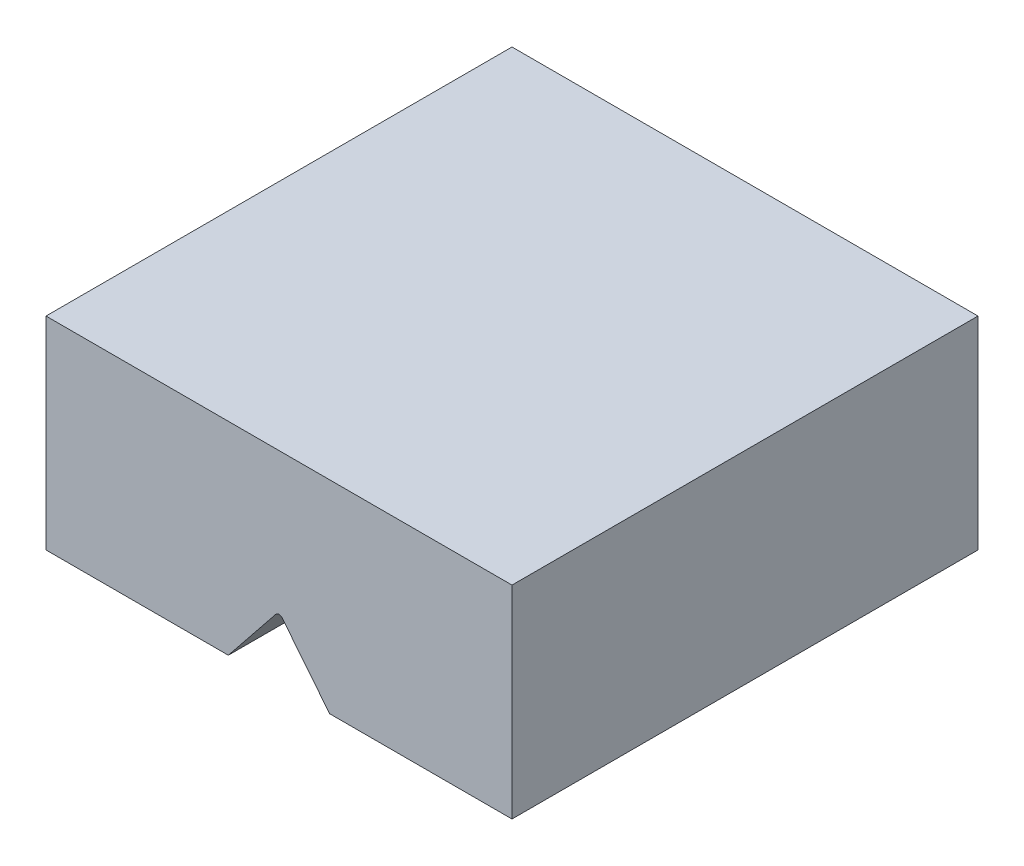
ISO-10303-21;
HEADER;
FILE_DESCRIPTION(('STEP AP214'),'2;1');
FILE_NAME('part.step','',(''),(''),'','','');
FILE_SCHEMA(('AUTOMOTIVE_DESIGN { 1 0 10303 214 1 1 1 1 }'));
ENDSEC;
DATA;
#1=APPLICATION_CONTEXT('core data for automotive mechanical design processes');
#2=APPLICATION_PROTOCOL_DEFINITION('international standard','automotive_design',2000,#1);
#3=PRODUCT_CONTEXT('',#1,'mechanical');
#4=PRODUCT('Part','Part','',(#3));
#5=PRODUCT_RELATED_PRODUCT_CATEGORY('part','',(#4));
#6=PRODUCT_DEFINITION_FORMATION('','',#4);
#7=PRODUCT_DEFINITION_CONTEXT('part definition',#1,'design');
#8=PRODUCT_DEFINITION('design','',#6,#7);
#9=PRODUCT_DEFINITION_SHAPE('','',#8);
#10=(LENGTH_UNIT() NAMED_UNIT(*) SI_UNIT(.MILLI.,.METRE.));
#11=(NAMED_UNIT(*) PLANE_ANGLE_UNIT() SI_UNIT($,.RADIAN.));
#12=(NAMED_UNIT(*) SI_UNIT($,.STERADIAN.) SOLID_ANGLE_UNIT());
#13=UNCERTAINTY_MEASURE_WITH_UNIT(LENGTH_MEASURE(1.E-05),#10,'distance_accuracy_value','');
#14=(GEOMETRIC_REPRESENTATION_CONTEXT(3) GLOBAL_UNCERTAINTY_ASSIGNED_CONTEXT((#13)) GLOBAL_UNIT_ASSIGNED_CONTEXT((#10,
#11,#12)) REPRESENTATION_CONTEXT('',''));
#15=CARTESIAN_POINT('',(0.,0.,0.));
#16=DIRECTION('',(0.,0.,1.));
#17=DIRECTION('',(1.,0.,0.));
#18=AXIS2_PLACEMENT_3D('',#15,#16,#17);
#19=CARTESIAN_POINT('',(0.,2.8,-11.5));
#20=DIRECTION('',(0.,0.,1.));
#21=DIRECTION('',(1.,0.,0.));
#22=AXIS2_PLACEMENT_3D('',#19,#20,#21);
#23=CYLINDRICAL_SURFACE('',#22,0.2);
#24=DIRECTION('',(0.,0.,1.));
#25=VECTOR('',#24,1.);
#26=CARTESIAN_POINT('',(-0.156072850189285,2.92506504481186,-11.5));
#27=LINE('',#26,#25);
#28=CARTESIAN_POINT('',(-0.156072850189285,2.92506504481186,2.19445694089307));
#29=VERTEX_POINT('',#28);
#30=CARTESIAN_POINT('',(-0.156072850189285,2.92506504481186,11.5));
#31=VERTEX_POINT('',#30);
#32=EDGE_CURVE('E117',#29,#31,#27,.T.);
#33=ORIENTED_EDGE('',*,*,#32,.F.);
#34=CARTESIAN_POINT('',(-0.156072850189285,2.92506504481186,2.19445694089307));
#35=CARTESIAN_POINT('',(-0.149043401205132,2.93385215810075,2.19495773255974));
#36=CARTESIAN_POINT('',(-0.141260961125301,2.94203144614838,2.1954765928498));
#37=CARTESIAN_POINT('',(-0.124441902674905,2.95697020830954,2.1964935797168));
#38=CARTESIAN_POINT('',(-0.115406008170376,2.96373049626863,2.19699171804631));
#39=CARTESIAN_POINT('',(-0.0963183832034033,2.9756406610106,2.1979113277802));
#40=CARTESIAN_POINT('',(-0.0862661431640993,2.98078972460446,2.19833276042628));
#41=CARTESIAN_POINT('',(-0.0654382759261339,2.98932616166957,2.19905120844462));
#42=CARTESIAN_POINT('',(-0.0546628281124281,2.99271397019372,2.19934825453845));
#43=CARTESIAN_POINT('',(-0.0327162842170274,2.99762548623186,2.19978403393633));
#44=CARTESIAN_POINT('',(-0.0215460890948283,2.99915318802112,2.19992310641964));
#45=CARTESIAN_POINT('',(0.000894188694473311,3.00031332998653,2.20002842729146));
#46=CARTESIAN_POINT('',(0.0121642801730675,2.99994560127907,2.19999466027991));
#47=CARTESIAN_POINT('',(0.0344464080922265,2.99732942295035,2.19975845150234));
#48=CARTESIAN_POINT('',(0.0454591379126752,2.99508682426655,2.1995565344924));
#49=CARTESIAN_POINT('',(0.0669541203329366,2.98879240070898,2.19900723785628));
#50=CARTESIAN_POINT('',(0.0774362318468145,2.98474009743741,2.19865981976822));
#51=CARTESIAN_POINT('',(0.0975934125639887,2.9749328435772,2.19785750928595));
#52=CARTESIAN_POINT('',(0.107266718902936,2.9691742920412,2.19740239000718));
#53=CARTESIAN_POINT('',(0.125497754414763,2.95612664705949,2.19643655794476));
#54=CARTESIAN_POINT('',(0.134057113740576,2.94883983183817,2.19592592845142));
#55=CARTESIAN_POINT('',(0.146933090529349,2.93587214921862,2.19509361053776));
#56=CARTESIAN_POINT('',(0.151652390930171,2.93058619510827,2.1947714981564));
#57=CARTESIAN_POINT('',(0.156072850189285,2.92506504481186,2.19445694089308));
#58=B_SPLINE_CURVE_WITH_KNOTS('',3,(#34,#35,#36,#37,#38,#39,#40,#41,#42,#43,#44,#45,#46,#47,#48,
#49,#50,#51,#52,#53,#54,#55,#56,#57),.UNSPECIFIED.,.F.,.F.,(4,2,2,2,2,2,2,2,2,2,2,4),(0.,
0.0337475148096952,0.0674756210459201,0.10122072258918,0.134957484688629,0.168621674111224,
0.202288863078285,0.235851376790638,0.269422768054256,0.303065520843038,0.336658473470274,
0.357897338058847),.UNSPECIFIED.);
#59=CARTESIAN_POINT('',(0.156072850189285,2.92506504481186,2.19445694089308));
#60=VERTEX_POINT('',#59);
#61=EDGE_CURVE('E108',#29,#60,#58,.T.);
#62=ORIENTED_EDGE('',*,*,#61,.T.);
#63=DIRECTION('',(0.,0.,1.));
#64=VECTOR('',#63,1.);
#65=CARTESIAN_POINT('',(0.156072850189285,2.92506504481186,-11.5));
#66=LINE('',#65,#64);
#67=CARTESIAN_POINT('',(0.156072850189285,2.92506504481186,11.5));
#68=VERTEX_POINT('',#67);
#69=EDGE_CURVE('E115',#60,#68,#66,.T.);
#70=ORIENTED_EDGE('',*,*,#69,.T.);
#71=CARTESIAN_POINT('',(0.,2.8,11.5));
#72=DIRECTION('',(0.,0.,1.));
#73=DIRECTION('',(-1.,0.,0.));
#74=AXIS2_PLACEMENT_3D('',#71,#72,#73);
#75=CIRCLE('',#74,0.2);
#76=EDGE_CURVE('E185',#68,#31,#75,.T.);
#77=ORIENTED_EDGE('',*,*,#76,.T.);
#78=EDGE_LOOP('',(#33,#62,#70,#77));
#79=FACE_BOUND('',#78,.T.);
#80=ADVANCED_FACE('F33',(#79),#23,.F.);
#81=CARTESIAN_POINT('',(0.,0.,0.));
#82=DIRECTION('',(0.,-1.,0.));
#83=DIRECTION('',(0.,0.,-1.));
#84=AXIS2_PLACEMENT_3D('',#81,#82,#83);
#85=PLANE('',#84);
#86=DIRECTION('',(0.,0.,1.));
#87=VECTOR('',#86,1.);
#88=CARTESIAN_POINT('',(-2.5,0.,-11.5));
#89=LINE('',#88,#87);
#90=CARTESIAN_POINT('',(-2.5,0.,-11.5));
#91=VERTEX_POINT('',#90);
#92=CARTESIAN_POINT('',(-2.5,0.,11.5));
#93=VERTEX_POINT('',#92);
#94=EDGE_CURVE('E148',#91,#93,#89,.T.);
#95=ORIENTED_EDGE('',*,*,#94,.T.);
#96=DIRECTION('',(1.,0.,0.));
#97=VECTOR('',#96,1.);
#98=CARTESIAN_POINT('',(-11.5,0.,11.5));
#99=LINE('',#98,#97);
#100=CARTESIAN_POINT('',(-11.5,0.,11.5));
#101=VERTEX_POINT('',#100);
#102=EDGE_CURVE('E149',#101,#93,#99,.T.);
#103=ORIENTED_EDGE('',*,*,#102,.F.);
#104=DIRECTION('',(0.,0.,1.));
#105=VECTOR('',#104,1.);
#106=CARTESIAN_POINT('',(-11.5,0.,11.5));
#107=LINE('',#106,#105);
#108=CARTESIAN_POINT('',(-11.5,0.,-11.5));
#109=VERTEX_POINT('',#108);
#110=EDGE_CURVE('E144',#109,#101,#107,.T.);
#111=ORIENTED_EDGE('',*,*,#110,.F.);
#112=DIRECTION('',(-1.,0.,0.));
#113=VECTOR('',#112,1.);
#114=CARTESIAN_POINT('',(-11.5,0.,-11.5));
#115=LINE('',#114,#113);
#116=EDGE_CURVE('E154',#91,#109,#115,.T.);
#117=ORIENTED_EDGE('',*,*,#116,.F.);
#118=EDGE_LOOP('',(#95,#103,#111,#117));
#119=FACE_BOUND('',#118,.T.);
#120=ADVANCED_FACE('F177',(#119),#85,.T.);
#121=CARTESIAN_POINT('',(-11.5,10.,11.5));
#122=DIRECTION('',(1.,0.,0.));
#123=DIRECTION('',(0.,0.,-1.));
#124=AXIS2_PLACEMENT_3D('',#121,#122,#123);
#125=PLANE('',#124);
#126=ORIENTED_EDGE('',*,*,#110,.T.);
#127=DIRECTION('',(0.,-1.,0.));
#128=VECTOR('',#127,1.);
#129=CARTESIAN_POINT('',(-11.5,10.,11.5));
#130=LINE('',#129,#128);
#131=CARTESIAN_POINT('',(-11.5,10.,11.5));
#132=VERTEX_POINT('',#131);
#133=EDGE_CURVE('E41',#132,#101,#130,.T.);
#134=ORIENTED_EDGE('',*,*,#133,.F.);
#135=DIRECTION('',(0.,0.,1.));
#136=VECTOR('',#135,1.);
#137=CARTESIAN_POINT('',(-11.5,10.,11.5));
#138=LINE('',#137,#136);
#139=CARTESIAN_POINT('',(-11.5,10.,-11.5));
#140=VERTEX_POINT('',#139);
#141=EDGE_CURVE('E133',#140,#132,#138,.T.);
#142=ORIENTED_EDGE('',*,*,#141,.F.);
#143=DIRECTION('',(0.,-1.,0.));
#144=VECTOR('',#143,1.);
#145=CARTESIAN_POINT('',(-11.5,10.,-11.5));
#146=LINE('',#145,#144);
#147=EDGE_CURVE('E143',#140,#109,#146,.T.);
#148=ORIENTED_EDGE('',*,*,#147,.T.);
#149=EDGE_LOOP('',(#126,#134,#142,#148));
#150=FACE_BOUND('',#149,.T.);
#151=ADVANCED_FACE('F35',(#150),#125,.F.);
#152=CARTESIAN_POINT('',(-11.5,10.,11.5));
#153=DIRECTION('',(0.,0.,-1.));
#154=DIRECTION('',(-1.,0.,0.));
#155=AXIS2_PLACEMENT_3D('',#152,#153,#154);
#156=PLANE('',#155);
#157=ORIENTED_EDGE('',*,*,#102,.T.);
#158=DIRECTION('',(-0.625325224059309,-0.780364250946425,0.));
#159=VECTOR('',#158,1.);
#160=CARTESIAN_POINT('',(-2.5,0.,11.5));
#161=LINE('',#160,#159);
#162=EDGE_CURVE('E183',#31,#93,#161,.T.);
#163=ORIENTED_EDGE('',*,*,#162,.F.);
#164=ORIENTED_EDGE('',*,*,#76,.F.);
#165=DIRECTION('',(-0.625325224059308,0.780364250946426,0.));
#166=VECTOR('',#165,1.);
#167=CARTESIAN_POINT('',(0.156072850189285,2.92506504481186,11.5));
#168=LINE('',#167,#166);
#169=CARTESIAN_POINT('',(2.5,0.,11.5));
#170=VERTEX_POINT('',#169);
#171=EDGE_CURVE('E122',#170,#68,#168,.T.);
#172=ORIENTED_EDGE('',*,*,#171,.F.);
#173=CARTESIAN_POINT('',(11.5,0.,11.5));
#174=VERTEX_POINT('',#173);
#175=EDGE_CURVE('E147',#170,#174,#99,.T.);
#176=ORIENTED_EDGE('',*,*,#175,.T.);
#177=DIRECTION('',(0.,-1.,0.));
#178=VECTOR('',#177,1.);
#179=CARTESIAN_POINT('',(11.5,10.,11.5));
#180=LINE('',#179,#178);
#181=CARTESIAN_POINT('',(11.5,10.,11.5));
#182=VERTEX_POINT('',#181);
#183=EDGE_CURVE('E162',#182,#174,#180,.T.);
#184=ORIENTED_EDGE('',*,*,#183,.F.);
#185=DIRECTION('',(1.,0.,0.));
#186=VECTOR('',#185,1.);
#187=CARTESIAN_POINT('',(-11.5,10.,11.5));
#188=LINE('',#187,#186);
#189=EDGE_CURVE('E136',#132,#182,#188,.T.);
#190=ORIENTED_EDGE('',*,*,#189,.F.);
#191=ORIENTED_EDGE('',*,*,#133,.T.);
#192=EDGE_LOOP('',(#157,#163,#164,#172,#176,#184,#190,#191));
#193=FACE_BOUND('',#192,.T.);
#194=ADVANCED_FACE('F167',(#193),#156,.F.);
#195=CARTESIAN_POINT('',(11.5,10.,11.5));
#196=DIRECTION('',(-1.,0.,0.));
#197=DIRECTION('',(0.,0.,1.));
#198=AXIS2_PLACEMENT_3D('',#195,#196,#197);
#199=PLANE('',#198);
#200=DIRECTION('',(0.,0.,-1.));
#201=VECTOR('',#200,1.);
#202=CARTESIAN_POINT('',(11.5,0.,11.5));
#203=LINE('',#202,#201);
#204=CARTESIAN_POINT('',(11.5,0.,-11.5));
#205=VERTEX_POINT('',#204);
#206=EDGE_CURVE('E152',#174,#205,#203,.T.);
#207=ORIENTED_EDGE('',*,*,#206,.T.);
#208=DIRECTION('',(0.,-1.,0.));
#209=VECTOR('',#208,1.);
#210=CARTESIAN_POINT('',(11.5,10.,-11.5));
#211=LINE('',#210,#209);
#212=CARTESIAN_POINT('',(11.5,10.,-11.5));
#213=VERTEX_POINT('',#212);
#214=EDGE_CURVE('E159',#213,#205,#211,.T.);
#215=ORIENTED_EDGE('',*,*,#214,.F.);
#216=DIRECTION('',(0.,0.,-1.));
#217=VECTOR('',#216,1.);
#218=CARTESIAN_POINT('',(11.5,10.,11.5));
#219=LINE('',#218,#217);
#220=EDGE_CURVE('E139',#182,#213,#219,.T.);
#221=ORIENTED_EDGE('',*,*,#220,.F.);
#222=ORIENTED_EDGE('',*,*,#183,.T.);
#223=EDGE_LOOP('',(#207,#215,#221,#222));
#224=FACE_BOUND('',#223,.T.);
#225=ADVANCED_FACE('F236',(#224),#199,.F.);
#226=CARTESIAN_POINT('',(-11.5,10.,-11.5));
#227=DIRECTION('',(0.,0.,1.));
#228=DIRECTION('',(1.,0.,0.));
#229=AXIS2_PLACEMENT_3D('',#226,#227,#228);
#230=PLANE('',#229);
#231=CARTESIAN_POINT('',(0.,2.8,-11.5));
#232=DIRECTION('',(0.,0.,1.));
#233=DIRECTION('',(-1.,0.,0.));
#234=AXIS2_PLACEMENT_3D('',#231,#232,#233);
#235=CIRCLE('',#234,0.2);
#236=CARTESIAN_POINT('',(0.156072850189285,2.92506504481186,-11.5));
#237=VERTEX_POINT('',#236);
#238=CARTESIAN_POINT('',(-0.156072850189285,2.92506504481186,-11.5));
#239=VERTEX_POINT('',#238);
#240=EDGE_CURVE('E189',#237,#239,#235,.T.);
#241=ORIENTED_EDGE('',*,*,#240,.T.);
#242=DIRECTION('',(-0.625325224059309,-0.780364250946425,0.));
#243=VECTOR('',#242,1.);
#244=CARTESIAN_POINT('',(-2.5,0.,-11.5));
#245=LINE('',#244,#243);
#246=EDGE_CURVE('E127',#239,#91,#245,.T.);
#247=ORIENTED_EDGE('',*,*,#246,.T.);
#248=ORIENTED_EDGE('',*,*,#116,.T.);
#249=ORIENTED_EDGE('',*,*,#147,.F.);
#250=DIRECTION('',(-1.,0.,0.));
#251=VECTOR('',#250,1.);
#252=CARTESIAN_POINT('',(-11.5,10.,-11.5));
#253=LINE('',#252,#251);
#254=EDGE_CURVE('E141',#213,#140,#253,.T.);
#255=ORIENTED_EDGE('',*,*,#254,.F.);
#256=ORIENTED_EDGE('',*,*,#214,.T.);
#257=CARTESIAN_POINT('',(2.5,0.,-11.5));
#258=VERTEX_POINT('',#257);
#259=EDGE_CURVE('E137',#205,#258,#115,.T.);
#260=ORIENTED_EDGE('',*,*,#259,.T.);
#261=DIRECTION('',(-0.625325224059308,0.780364250946426,0.));
#262=VECTOR('',#261,1.);
#263=CARTESIAN_POINT('',(0.156072850189285,2.92506504481186,-11.5));
#264=LINE('',#263,#262);
#265=EDGE_CURVE('E55',#258,#237,#264,.T.);
#266=ORIENTED_EDGE('',*,*,#265,.T.);
#267=EDGE_LOOP('',(#241,#247,#248,#249,#255,#256,#260,#266));
#268=FACE_BOUND('',#267,.T.);
#269=ADVANCED_FACE('F233',(#268),#230,.F.);
#270=CARTESIAN_POINT('',(0.,10.,0.));
#271=DIRECTION('',(0.,-1.,0.));
#272=DIRECTION('',(0.,0.,-1.));
#273=AXIS2_PLACEMENT_3D('',#270,#271,#272);
#274=PLANE('',#273);
#275=ORIENTED_EDGE('',*,*,#141,.T.);
#276=ORIENTED_EDGE('',*,*,#189,.T.);
#277=ORIENTED_EDGE('',*,*,#220,.T.);
#278=ORIENTED_EDGE('',*,*,#254,.T.);
#279=EDGE_LOOP('',(#275,#276,#277,#278));
#280=FACE_BOUND('',#279,.T.);
#281=ADVANCED_FACE('F221',(#280),#274,.F.);
#282=DIRECTION('',(0.,0.,1.));
#283=VECTOR('',#282,1.);
#284=CARTESIAN_POINT('',(2.5,0.,-11.5));
#285=LINE('',#284,#283);
#286=EDGE_CURVE('E125',#258,#170,#285,.T.);
#287=ORIENTED_EDGE('',*,*,#286,.F.);
#288=ORIENTED_EDGE('',*,*,#259,.F.);
#289=ORIENTED_EDGE('',*,*,#206,.F.);
#290=ORIENTED_EDGE('',*,*,#175,.F.);
#291=EDGE_LOOP('',(#287,#288,#289,#290));
#292=FACE_BOUND('',#291,.T.);
#293=ADVANCED_FACE('F215',(#292),#85,.T.);
#294=CARTESIAN_POINT('',(-2.5,0.,-11.5));
#295=DIRECTION('',(-0.780364250946425,0.625325224059309,0.));
#296=DIRECTION('',(-0.625325224059309,-0.780364250946425,0.));
#297=AXIS2_PLACEMENT_3D('',#294,#295,#296);
#298=PLANE('',#297);
#299=CARTESIAN_POINT('',(-0.156072850189285,2.92506504481186,-2.19445694089307));
#300=VERTEX_POINT('',#299);
#301=EDGE_CURVE('E130',#239,#300,#27,.T.);
#302=ORIENTED_EDGE('',*,*,#301,.T.);
#303=CARTESIAN_POINT('',(0.,3.11983357188392,0.));
#304=DIRECTION('',(-0.780364250946425,0.625325224059309,0.));
#305=DIRECTION('',(-0.625325224059309,-0.780364250946425,0.));
#306=AXIS2_PLACEMENT_3D('',#303,#304,#305);
#307=ELLIPSE('',#306,3.5181692907231,2.2);
#308=EDGE_CURVE('E118',#300,#29,#307,.T.);
#309=ORIENTED_EDGE('',*,*,#308,.T.);
#310=ORIENTED_EDGE('',*,*,#32,.T.);
#311=ORIENTED_EDGE('',*,*,#162,.T.);
#312=ORIENTED_EDGE('',*,*,#94,.F.);
#313=ORIENTED_EDGE('',*,*,#246,.F.);
#314=EDGE_LOOP('',(#302,#309,#310,#311,#312,#313));
#315=FACE_BOUND('',#314,.T.);
#316=ADVANCED_FACE('F212',(#315),#298,.F.);
#317=CARTESIAN_POINT('',(0.156072850189285,2.92506504481186,-2.19445694089308));
#318=VERTEX_POINT('',#317);
#319=EDGE_CURVE('E124',#237,#318,#66,.T.);
#320=ORIENTED_EDGE('',*,*,#319,.T.);
#321=CARTESIAN_POINT('',(0.156072850189285,2.92506504481186,-2.19445694089307));
#322=CARTESIAN_POINT('',(0.149043401205132,2.93385215810075,-2.19495773255974));
#323=CARTESIAN_POINT('',(0.141260961125301,2.94203144614838,-2.1954765928498));
#324=CARTESIAN_POINT('',(0.124441902674905,2.95697020830954,-2.1964935797168));
#325=CARTESIAN_POINT('',(0.115406008170375,2.96373049626863,-2.19699171804631));
#326=CARTESIAN_POINT('',(0.0963183832034026,2.9756406610106,-2.1979113277802));
#327=CARTESIAN_POINT('',(0.0862661431640985,2.98078972460446,-2.19833276042628));
#328=CARTESIAN_POINT('',(0.065438275926133,2.98932616166957,-2.19905120844462));
#329=CARTESIAN_POINT('',(0.0546628281124271,2.99271397019372,-2.19934825453845));
#330=CARTESIAN_POINT('',(0.0327162842170264,2.99762548623186,-2.19978403393633));
#331=CARTESIAN_POINT('',(0.0215460890948272,2.99915318802112,-2.19992310641964));
#332=CARTESIAN_POINT('',(-0.000894188694474359,3.00031332998653,-2.20002842729146));
#333=CARTESIAN_POINT('',(-0.0121642801730685,2.99994560127907,-2.19999466027991));
#334=CARTESIAN_POINT('',(-0.0344464080922276,2.99732942295035,-2.19975845150234));
#335=CARTESIAN_POINT('',(-0.0454591379126763,2.99508682426655,-2.1995565344924));
#336=CARTESIAN_POINT('',(-0.0669541203329377,2.98879240070898,-2.19900723785628));
#337=CARTESIAN_POINT('',(-0.0774362318468155,2.98474009743741,-2.19865981976822));
#338=CARTESIAN_POINT('',(-0.0975934125639895,2.9749328435772,-2.19785750928595));
#339=CARTESIAN_POINT('',(-0.107266718902936,2.9691742920412,-2.19740239000718));
#340=CARTESIAN_POINT('',(-0.125497754414764,2.95612664705949,-2.19643655794476));
#341=CARTESIAN_POINT('',(-0.134057113740577,2.94883983183817,-2.19592592845142));
#342=CARTESIAN_POINT('',(-0.146933090529349,2.93587214921862,-2.19509361053776));
#343=CARTESIAN_POINT('',(-0.151652390930171,2.93058619510827,-2.1947714981564));
#344=CARTESIAN_POINT('',(-0.156072850189285,2.92506504481186,-2.19445694089308));
#345=B_SPLINE_CURVE_WITH_KNOTS('',3,(#321,#322,#323,#324,#325,#326,#327,#328,#329,#330,#331,
#332,#333,#334,#335,#336,#337,#338,#339,#340,#341,#342,#343,#344),.UNSPECIFIED.,.F.,.F.,(4,2,2,
2,2,2,2,2,2,2,2,4),(0.,0.0337475148096949,0.0674756210459203,0.10122072258918,0.134957484688629,
0.168621674111224,0.202288863078286,0.235851376790638,0.269422768054256,0.303065520843038,
0.336658473470274,0.357897338058848),.UNSPECIFIED.);
#346=EDGE_CURVE('E48',#318,#300,#345,.T.);
#347=ORIENTED_EDGE('',*,*,#346,.T.);
#348=ORIENTED_EDGE('',*,*,#301,.F.);
#349=ORIENTED_EDGE('',*,*,#240,.F.);
#350=EDGE_LOOP('',(#320,#347,#348,#349));
#351=FACE_BOUND('',#350,.T.);
#352=ADVANCED_FACE('F203',(#351),#23,.F.);
#353=CARTESIAN_POINT('',(0.156072850189285,2.92506504481186,-11.5));
#354=DIRECTION('',(0.780364250946426,0.625325224059308,0.));
#355=DIRECTION('',(-0.625325224059308,0.780364250946426,0.));
#356=AXIS2_PLACEMENT_3D('',#353,#354,#355);
#357=PLANE('',#356);
#358=ORIENTED_EDGE('',*,*,#69,.F.);
#359=CARTESIAN_POINT('',(0.,3.11983357188392,0.));
#360=DIRECTION('',(0.780364250946426,0.625325224059308,0.));
#361=DIRECTION('',(0.625325224059308,-0.780364250946426,0.));
#362=AXIS2_PLACEMENT_3D('',#359,#360,#361);
#363=ELLIPSE('',#362,3.5181692907231,2.2);
#364=EDGE_CURVE('E11',#60,#318,#363,.T.);
#365=ORIENTED_EDGE('',*,*,#364,.T.);
#366=ORIENTED_EDGE('',*,*,#319,.F.);
#367=ORIENTED_EDGE('',*,*,#265,.F.);
#368=ORIENTED_EDGE('',*,*,#286,.T.);
#369=ORIENTED_EDGE('',*,*,#171,.T.);
#370=EDGE_LOOP('',(#358,#365,#366,#367,#368,#369));
#371=FACE_BOUND('',#370,.T.);
#372=ADVANCED_FACE('F120',(#371),#357,.F.);
#373=CARTESIAN_POINT('',(0.,5.3,0.));
#374=DIRECTION('',(0.,-1.,0.));
#375=DIRECTION('',(0.,0.,-1.));
#376=AXIS2_PLACEMENT_3D('',#373,#374,#375);
#377=CYLINDRICAL_SURFACE('',#376,2.2);
#378=CARTESIAN_POINT('',(0.,5.3,0.));
#379=DIRECTION('',(0.,-1.,0.));
#380=DIRECTION('',(0.,0.,-1.));
#381=AXIS2_PLACEMENT_3D('',#378,#379,#380);
#382=CIRCLE('',#381,2.2);
#383=CARTESIAN_POINT('',(0.,5.3,-2.2));
#384=VERTEX_POINT('',#383);
#385=EDGE_CURVE('E305',#384,#384,#382,.T.);
#386=ORIENTED_EDGE('',*,*,#385,.F.);
#387=EDGE_LOOP('',(#386));
#388=FACE_BOUND('',#387,.T.);
#389=ORIENTED_EDGE('',*,*,#346,.F.);
#390=ORIENTED_EDGE('',*,*,#364,.F.);
#391=ORIENTED_EDGE('',*,*,#61,.F.);
#392=ORIENTED_EDGE('',*,*,#308,.F.);
#393=EDGE_LOOP('',(#389,#390,#391,#392));
#394=FACE_BOUND('',#393,.T.);
#395=ADVANCED_FACE('F107',(#388,#394),#377,.F.);
#396=CARTESIAN_POINT('',(0.,5.3,0.));
#397=DIRECTION('',(0.,-1.,0.));
#398=DIRECTION('',(0.,0.,-1.));
#399=AXIS2_PLACEMENT_3D('',#396,#397,#398);
#400=PLANE('',#399);
#401=ORIENTED_EDGE('',*,*,#385,.T.);
#402=EDGE_LOOP('',(#401));
#403=FACE_BOUND('',#402,.T.);
#404=ADVANCED_FACE('F210',(#403),#400,.T.);
#405=CLOSED_SHELL('',(#80,#120,#151,#194,#225,#269,#281,#293,#316,#352,#372,#395,#404));
#406=MANIFOLD_SOLID_BREP('B2',#405);
#407=ADVANCED_BREP_SHAPE_REPRESENTATION('',(#18,#406),#14);
#408=SHAPE_DEFINITION_REPRESENTATION(#9,#407);
ENDSEC;
END-ISO-10303-21;
